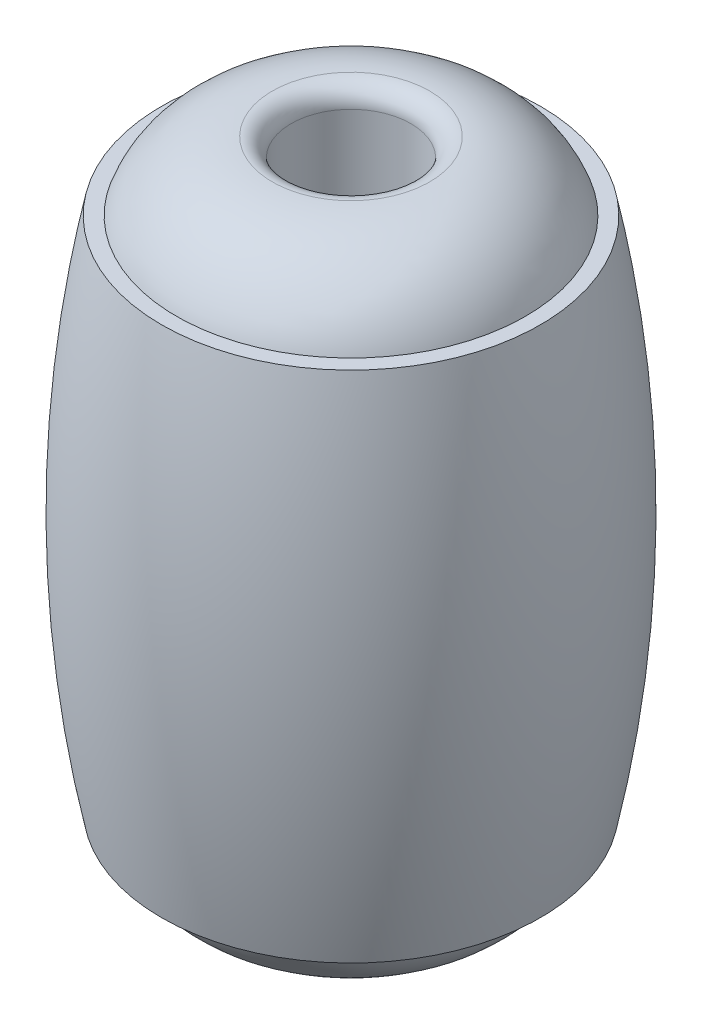
ISO-10303-21;
HEADER;
FILE_DESCRIPTION(('STEP AP214'),'2;1');
FILE_NAME('part.step','',(''),(''),'','','');
FILE_SCHEMA(('AUTOMOTIVE_DESIGN { 1 0 10303 214 1 1 1 1 }'));
ENDSEC;
DATA;
#1=APPLICATION_CONTEXT('core data for automotive mechanical design processes');
#2=APPLICATION_PROTOCOL_DEFINITION('international standard','automotive_design',2000,#1);
#3=PRODUCT_CONTEXT('',#1,'mechanical');
#4=PRODUCT('Part','Part','',(#3));
#5=PRODUCT_RELATED_PRODUCT_CATEGORY('part','',(#4));
#6=PRODUCT_DEFINITION_FORMATION('','',#4);
#7=PRODUCT_DEFINITION_CONTEXT('part definition',#1,'design');
#8=PRODUCT_DEFINITION('design','',#6,#7);
#9=PRODUCT_DEFINITION_SHAPE('','',#8);
#10=(LENGTH_UNIT() NAMED_UNIT(*) SI_UNIT(.MILLI.,.METRE.));
#11=(NAMED_UNIT(*) PLANE_ANGLE_UNIT() SI_UNIT($,.RADIAN.));
#12=(NAMED_UNIT(*) SI_UNIT($,.STERADIAN.) SOLID_ANGLE_UNIT());
#13=UNCERTAINTY_MEASURE_WITH_UNIT(LENGTH_MEASURE(1.E-05),#10,'distance_accuracy_value','');
#14=(GEOMETRIC_REPRESENTATION_CONTEXT(3) GLOBAL_UNCERTAINTY_ASSIGNED_CONTEXT((#13)) GLOBAL_UNIT_ASSIGNED_CONTEXT((#10,
#11,#12)) REPRESENTATION_CONTEXT('',''));
#15=CARTESIAN_POINT('',(0.,0.,0.));
#16=DIRECTION('',(0.,0.,1.));
#17=DIRECTION('',(1.,0.,0.));
#18=AXIS2_PLACEMENT_3D('',#15,#16,#17);
#19=CARTESIAN_POINT('',(0.,0.,0.));
#20=DIRECTION('',(0.,-1.,0.));
#21=DIRECTION('',(0.,0.,-1.));
#22=AXIS2_PLACEMENT_3D('',#19,#20,#21);
#23=CYLINDRICAL_SURFACE('',#22,1.75);
#24=CARTESIAN_POINT('',(0.,8.95,0.));
#25=DIRECTION('',(0.,-1.,0.));
#26=DIRECTION('',(0.,0.,-1.));
#27=AXIS2_PLACEMENT_3D('',#24,#25,#26);
#28=CIRCLE('',#27,1.75);
#29=CARTESIAN_POINT('',(0.,8.95,-1.75));
#30=VERTEX_POINT('',#29);
#31=EDGE_CURVE('E60',#30,#30,#28,.T.);
#32=ORIENTED_EDGE('',*,*,#31,.F.);
#33=EDGE_LOOP('',(#32));
#34=FACE_BOUND('',#33,.T.);
#35=CARTESIAN_POINT('',(0.,-8.95,0.));
#36=DIRECTION('',(0.,-1.,0.));
#37=DIRECTION('',(0.,0.,-1.));
#38=AXIS2_PLACEMENT_3D('',#35,#36,#37);
#39=CIRCLE('',#38,1.75);
#40=CARTESIAN_POINT('',(0.,-8.95,-1.75));
#41=VERTEX_POINT('',#40);
#42=EDGE_CURVE('E78',#41,#41,#39,.T.);
#43=ORIENTED_EDGE('',*,*,#42,.T.);
#44=EDGE_LOOP('',(#43));
#45=FACE_BOUND('',#44,.T.);
#46=ADVANCED_FACE('F43',(#34,#45),#23,.F.);
#47=CARTESIAN_POINT('',(0.,0.,0.));
#48=DIRECTION('',(0.,-1.,0.));
#49=DIRECTION('',(0.,0.,-1.));
#50=AXIS2_PLACEMENT_3D('',#47,#48,#49);
#51=DEGENERATE_TOROIDAL_SURFACE('',#50,30.7,37.,.F.);
#52=CARTESIAN_POINT('',(0.,7.5,0.));
#53=DIRECTION('',(0.,-1.,0.));
#54=DIRECTION('',(0.,0.,-1.));
#55=AXIS2_PLACEMENT_3D('',#52,#53,#54);
#56=CIRCLE('',#55,5.53189202898463);
#57=CARTESIAN_POINT('',(0.,7.5,-5.53189202898463));
#58=VERTEX_POINT('',#57);
#59=EDGE_CURVE('E10',#58,#58,#56,.T.);
#60=ORIENTED_EDGE('',*,*,#59,.T.);
#61=EDGE_LOOP('',(#60));
#62=FACE_BOUND('',#61,.T.);
#63=CARTESIAN_POINT('',(0.,-7.5,0.));
#64=DIRECTION('',(0.,-1.,0.));
#65=DIRECTION('',(0.,0.,-1.));
#66=AXIS2_PLACEMENT_3D('',#63,#64,#65);
#67=CIRCLE('',#66,5.53189202898463);
#68=CARTESIAN_POINT('',(0.,-7.5,-5.53189202898463));
#69=VERTEX_POINT('',#68);
#70=EDGE_CURVE('E66',#69,#69,#67,.T.);
#71=ORIENTED_EDGE('',*,*,#70,.F.);
#72=EDGE_LOOP('',(#71));
#73=FACE_BOUND('',#72,.T.);
#74=ADVANCED_FACE('F103',(#62,#73),#51,.F.);
#75=CARTESIAN_POINT('',(5.53189202898463,7.5,0.));
#76=DIRECTION('',(0.,1.,0.));
#77=DIRECTION('',(0.,0.,1.));
#78=AXIS2_PLACEMENT_3D('',#75,#76,#77);
#79=PLANE('',#78);
#80=CARTESIAN_POINT('',(0.,7.5,0.));
#81=DIRECTION('',(0.,-1.,0.));
#82=DIRECTION('',(0.,0.,-1.));
#83=AXIS2_PLACEMENT_3D('',#80,#81,#82);
#84=CIRCLE('',#83,5.1);
#85=CARTESIAN_POINT('',(0.,7.5,-5.1));
#86=VERTEX_POINT('',#85);
#87=EDGE_CURVE('E50',#86,#86,#84,.T.);
#88=ORIENTED_EDGE('',*,*,#87,.T.);
#89=EDGE_LOOP('',(#88));
#90=FACE_BOUND('',#89,.T.);
#91=ORIENTED_EDGE('',*,*,#59,.F.);
#92=EDGE_LOOP('',(#91));
#93=FACE_BOUND('',#92,.T.);
#94=ADVANCED_FACE('F105',(#90,#93),#79,.T.);
#95=CARTESIAN_POINT('',(0.,6.54,0.));
#96=DIRECTION('',(0.,-1.,0.));
#97=DIRECTION('',(0.,0.,-1.));
#98=AXIS2_PLACEMENT_3D('',#95,#96,#97);
#99=DEGENERATE_TOROIDAL_SURFACE('',#98,2.3,2.96,.T.);
#100=CARTESIAN_POINT('',(0.,9.5,0.));
#101=DIRECTION('',(0.,-1.,0.));
#102=DIRECTION('',(0.,0.,-1.));
#103=AXIS2_PLACEMENT_3D('',#100,#101,#102);
#104=CIRCLE('',#103,2.3);
#105=CARTESIAN_POINT('',(0.,9.5,-2.3));
#106=VERTEX_POINT('',#105);
#107=EDGE_CURVE('E55',#106,#106,#104,.T.);
#108=ORIENTED_EDGE('',*,*,#107,.T.);
#109=EDGE_LOOP('',(#108));
#110=FACE_BOUND('',#109,.T.);
#111=ORIENTED_EDGE('',*,*,#87,.F.);
#112=EDGE_LOOP('',(#111));
#113=FACE_BOUND('',#112,.T.);
#114=ADVANCED_FACE('F110',(#110,#113),#99,.T.);
#115=CARTESIAN_POINT('',(0.,8.95,0.));
#116=DIRECTION('',(0.,-1.,0.));
#117=DIRECTION('',(0.,0.,-1.));
#118=AXIS2_PLACEMENT_3D('',#115,#116,#117);
#119=TOROIDAL_SURFACE('',#118,2.3,0.55);
#120=ORIENTED_EDGE('',*,*,#31,.T.);
#121=EDGE_LOOP('',(#120));
#122=FACE_BOUND('',#121,.T.);
#123=ORIENTED_EDGE('',*,*,#107,.F.);
#124=EDGE_LOOP('',(#123));
#125=FACE_BOUND('',#124,.T.);
#126=ADVANCED_FACE('F99',(#122,#125),#119,.T.);
#127=CARTESIAN_POINT('',(5.53189202898463,-7.5,0.));
#128=DIRECTION('',(0.,-1.,0.));
#129=DIRECTION('',(0.,0.,1.));
#130=AXIS2_PLACEMENT_3D('',#127,#128,#129);
#131=PLANE('',#130);
#132=CARTESIAN_POINT('',(0.,-7.5,0.));
#133=DIRECTION('',(0.,-1.,0.));
#134=DIRECTION('',(0.,0.,-1.));
#135=AXIS2_PLACEMENT_3D('',#132,#133,#134);
#136=CIRCLE('',#135,5.1);
#137=CARTESIAN_POINT('',(0.,-7.5,-5.1));
#138=VERTEX_POINT('',#137);
#139=EDGE_CURVE('E70',#138,#138,#136,.T.);
#140=ORIENTED_EDGE('',*,*,#139,.F.);
#141=EDGE_LOOP('',(#140));
#142=FACE_BOUND('',#141,.T.);
#143=ORIENTED_EDGE('',*,*,#70,.T.);
#144=EDGE_LOOP('',(#143));
#145=FACE_BOUND('',#144,.T.);
#146=ADVANCED_FACE('F93',(#142,#145),#131,.T.);
#147=CARTESIAN_POINT('',(0.,-6.54,0.));
#148=DIRECTION('',(0.,1.,0.));
#149=DIRECTION('',(0.,0.,-1.));
#150=AXIS2_PLACEMENT_3D('',#147,#148,#149);
#151=DEGENERATE_TOROIDAL_SURFACE('',#150,2.3,2.96,.T.);
#152=CARTESIAN_POINT('',(0.,-9.5,0.));
#153=DIRECTION('',(0.,-1.,0.));
#154=DIRECTION('',(0.,0.,-1.));
#155=AXIS2_PLACEMENT_3D('',#152,#153,#154);
#156=CIRCLE('',#155,2.3);
#157=CARTESIAN_POINT('',(0.,-9.5,-2.3));
#158=VERTEX_POINT('',#157);
#159=EDGE_CURVE('E74',#158,#158,#156,.T.);
#160=ORIENTED_EDGE('',*,*,#159,.F.);
#161=EDGE_LOOP('',(#160));
#162=FACE_BOUND('',#161,.T.);
#163=ORIENTED_EDGE('',*,*,#139,.T.);
#164=EDGE_LOOP('',(#163));
#165=FACE_BOUND('',#164,.T.);
#166=ADVANCED_FACE('F87',(#162,#165),#151,.T.);
#167=CARTESIAN_POINT('',(0.,-8.95,0.));
#168=DIRECTION('',(0.,1.,0.));
#169=DIRECTION('',(0.,0.,-1.));
#170=AXIS2_PLACEMENT_3D('',#167,#168,#169);
#171=TOROIDAL_SURFACE('',#170,2.3,0.55);
#172=ORIENTED_EDGE('',*,*,#42,.F.);
#173=EDGE_LOOP('',(#172));
#174=FACE_BOUND('',#173,.T.);
#175=ORIENTED_EDGE('',*,*,#159,.T.);
#176=EDGE_LOOP('',(#175));
#177=FACE_BOUND('',#176,.T.);
#178=ADVANCED_FACE('F84',(#174,#177),#171,.T.);
#179=CLOSED_SHELL('',(#46,#74,#94,#114,#126,#146,#166,#178));
#180=MANIFOLD_SOLID_BREP('B2',#179);
#181=ADVANCED_BREP_SHAPE_REPRESENTATION('',(#18,#180),#14);
#182=SHAPE_DEFINITION_REPRESENTATION(#9,#181);
ENDSEC;
END-ISO-10303-21;
